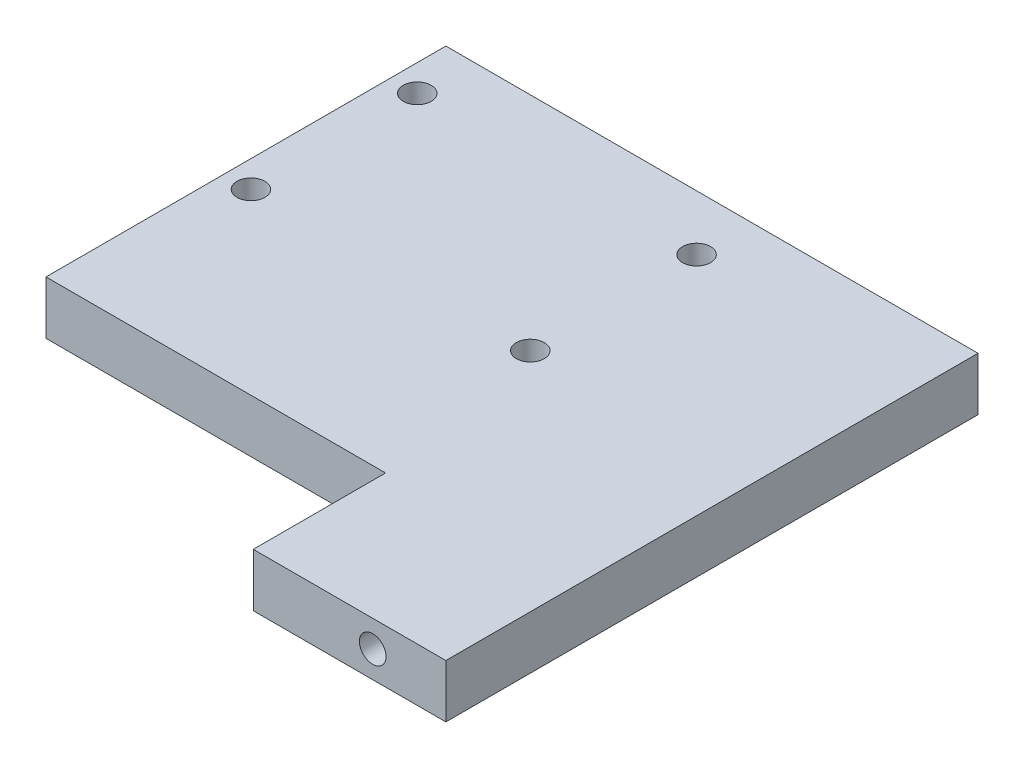
ISO-10303-21;
HEADER;
FILE_DESCRIPTION(('STEP AP214'),'2;1');
FILE_NAME('part.step','',(''),(''),'','','');
FILE_SCHEMA(('AUTOMOTIVE_DESIGN { 1 0 10303 214 1 1 1 1 }'));
ENDSEC;
DATA;
#1=APPLICATION_CONTEXT('core data for automotive mechanical design processes');
#2=APPLICATION_PROTOCOL_DEFINITION('international standard','automotive_design',2000,#1);
#3=PRODUCT_CONTEXT('',#1,'mechanical');
#4=PRODUCT('Part','Part','',(#3));
#5=PRODUCT_RELATED_PRODUCT_CATEGORY('part','',(#4));
#6=PRODUCT_DEFINITION_FORMATION('','',#4);
#7=PRODUCT_DEFINITION_CONTEXT('part definition',#1,'design');
#8=PRODUCT_DEFINITION('design','',#6,#7);
#9=PRODUCT_DEFINITION_SHAPE('','',#8);
#10=(LENGTH_UNIT() NAMED_UNIT(*) SI_UNIT(.MILLI.,.METRE.));
#11=(NAMED_UNIT(*) PLANE_ANGLE_UNIT() SI_UNIT($,.RADIAN.));
#12=(NAMED_UNIT(*) SI_UNIT($,.STERADIAN.) SOLID_ANGLE_UNIT());
#13=UNCERTAINTY_MEASURE_WITH_UNIT(LENGTH_MEASURE(1.E-05),#10,'distance_accuracy_value','');
#14=(GEOMETRIC_REPRESENTATION_CONTEXT(3) GLOBAL_UNCERTAINTY_ASSIGNED_CONTEXT((#13)) GLOBAL_UNIT_ASSIGNED_CONTEXT((#10,
#11,#12)) REPRESENTATION_CONTEXT('',''));
#15=CARTESIAN_POINT('',(0.,0.,0.));
#16=DIRECTION('',(0.,0.,1.));
#17=DIRECTION('',(1.,0.,0.));
#18=AXIS2_PLACEMENT_3D('',#15,#16,#17);
#19=CARTESIAN_POINT('',(20.,4.,20.));
#20=DIRECTION('',(-1.,0.,0.));
#21=DIRECTION('',(0.,0.,1.));
#22=AXIS2_PLACEMENT_3D('',#19,#20,#21);
#23=PLANE('',#22);
#24=DIRECTION('',(0.,0.,-1.));
#25=VECTOR('',#24,1.);
#26=CARTESIAN_POINT('',(20.,0.,20.));
#27=LINE('',#26,#25);
#28=CARTESIAN_POINT('',(20.,0.,20.));
#29=VERTEX_POINT('',#28);
#30=CARTESIAN_POINT('',(20.,0.,-20.));
#31=VERTEX_POINT('',#30);
#32=EDGE_CURVE('E140',#29,#31,#27,.T.);
#33=ORIENTED_EDGE('',*,*,#32,.T.);
#34=DIRECTION('',(0.,-1.,0.));
#35=VECTOR('',#34,1.);
#36=CARTESIAN_POINT('',(20.,4.,-20.));
#37=LINE('',#36,#35);
#38=CARTESIAN_POINT('',(20.,4.,-20.));
#39=VERTEX_POINT('',#38);
#40=EDGE_CURVE('E11',#39,#31,#37,.T.);
#41=ORIENTED_EDGE('',*,*,#40,.F.);
#42=DIRECTION('',(0.,0.,-1.));
#43=VECTOR('',#42,1.);
#44=CARTESIAN_POINT('',(20.,4.,20.));
#45=LINE('',#44,#43);
#46=CARTESIAN_POINT('',(20.,4.,20.));
#47=VERTEX_POINT('',#46);
#48=EDGE_CURVE('E136',#47,#39,#45,.T.);
#49=ORIENTED_EDGE('',*,*,#48,.F.);
#50=DIRECTION('',(0.,-1.,0.));
#51=VECTOR('',#50,1.);
#52=CARTESIAN_POINT('',(20.,4.,20.));
#53=LINE('',#52,#51);
#54=EDGE_CURVE('E134',#47,#29,#53,.T.);
#55=ORIENTED_EDGE('',*,*,#54,.T.);
#56=EDGE_LOOP('',(#33,#41,#49,#55));
#57=FACE_BOUND('',#56,.T.);
#58=ADVANCED_FACE('F34',(#57),#23,.F.);
#59=CARTESIAN_POINT('',(-20.,4.,-20.));
#60=DIRECTION('',(0.,0.,1.));
#61=DIRECTION('',(1.,0.,0.));
#62=AXIS2_PLACEMENT_3D('',#59,#60,#61);
#63=PLANE('',#62);
#64=CARTESIAN_POINT('',(-14.5,2.,-20.));
#65=DIRECTION('',(0.,0.,-1.));
#66=DIRECTION('',(-1.,0.,0.));
#67=AXIS2_PLACEMENT_3D('',#64,#65,#66);
#68=CIRCLE('',#67,1.);
#69=CARTESIAN_POINT('',(-15.5,2.,-20.));
#70=VERTEX_POINT('',#69);
#71=EDGE_CURVE('E186',#70,#70,#68,.T.);
#72=ORIENTED_EDGE('',*,*,#71,.F.);
#73=EDGE_LOOP('',(#72));
#74=FACE_BOUND('',#73,.T.);
#75=CARTESIAN_POINT('',(14.5,2.,-20.));
#76=DIRECTION('',(0.,0.,-1.));
#77=DIRECTION('',(-1.,0.,0.));
#78=AXIS2_PLACEMENT_3D('',#75,#76,#77);
#79=CIRCLE('',#78,1.);
#80=CARTESIAN_POINT('',(13.5,2.,-20.));
#81=VERTEX_POINT('',#80);
#82=EDGE_CURVE('E190',#81,#81,#79,.T.);
#83=ORIENTED_EDGE('',*,*,#82,.F.);
#84=EDGE_LOOP('',(#83));
#85=FACE_BOUND('',#84,.T.);
#86=DIRECTION('',(-1.,0.,0.));
#87=VECTOR('',#86,1.);
#88=CARTESIAN_POINT('',(-20.,0.,-20.));
#89=LINE('',#88,#87);
#90=CARTESIAN_POINT('',(-20.,0.,-20.));
#91=VERTEX_POINT('',#90);
#92=EDGE_CURVE('E143',#31,#91,#89,.T.);
#93=ORIENTED_EDGE('',*,*,#92,.T.);
#94=DIRECTION('',(0.,-1.,0.));
#95=VECTOR('',#94,1.);
#96=CARTESIAN_POINT('',(-20.,4.,-20.));
#97=LINE('',#96,#95);
#98=CARTESIAN_POINT('',(-20.,4.,-20.));
#99=VERTEX_POINT('',#98);
#100=EDGE_CURVE('E41',#99,#91,#97,.T.);
#101=ORIENTED_EDGE('',*,*,#100,.F.);
#102=DIRECTION('',(-1.,0.,0.));
#103=VECTOR('',#102,1.);
#104=CARTESIAN_POINT('',(-20.,4.,-20.));
#105=LINE('',#104,#103);
#106=EDGE_CURVE('E130',#39,#99,#105,.T.);
#107=ORIENTED_EDGE('',*,*,#106,.F.);
#108=ORIENTED_EDGE('',*,*,#40,.T.);
#109=EDGE_LOOP('',(#93,#101,#107,#108));
#110=FACE_BOUND('',#109,.T.);
#111=ADVANCED_FACE('F207',(#74,#85,#110),#63,.F.);
#112=CARTESIAN_POINT('',(-20.,4.,20.));
#113=DIRECTION('',(1.,0.,0.));
#114=DIRECTION('',(0.,0.,-1.));
#115=AXIS2_PLACEMENT_3D('',#112,#113,#114);
#116=PLANE('',#115);
#117=DIRECTION('',(0.,0.,1.));
#118=VECTOR('',#117,1.);
#119=CARTESIAN_POINT('',(-20.,0.,20.));
#120=LINE('',#119,#118);
#121=CARTESIAN_POINT('',(-20.,0.,-0.123296756228797));
#122=VERTEX_POINT('',#121);
#123=CARTESIAN_POINT('',(-20.,0.,10.0582705619843));
#124=VERTEX_POINT('',#123);
#125=EDGE_CURVE('E126',#122,#124,#120,.T.);
#126=ORIENTED_EDGE('',*,*,#125,.T.);
#127=DIRECTION('',(0.,-1.,0.));
#128=VECTOR('',#127,1.);
#129=CARTESIAN_POINT('',(-20.,4.,10.0582705619843));
#130=LINE('',#129,#128);
#131=CARTESIAN_POINT('',(-20.,4.,10.0582705619843));
#132=VERTEX_POINT('',#131);
#133=EDGE_CURVE('E48',#132,#124,#130,.T.);
#134=ORIENTED_EDGE('',*,*,#133,.F.);
#135=DIRECTION('',(0.,0.,1.));
#136=VECTOR('',#135,1.);
#137=CARTESIAN_POINT('',(-20.,4.,20.));
#138=LINE('',#137,#136);
#139=EDGE_CURVE('E124',#99,#132,#138,.T.);
#140=ORIENTED_EDGE('',*,*,#139,.F.);
#141=ORIENTED_EDGE('',*,*,#100,.T.);
#142=CARTESIAN_POINT('',(-20.,0.,-17.8471805011251));
#143=VERTEX_POINT('',#142);
#144=EDGE_CURVE('E146',#91,#143,#120,.T.);
#145=ORIENTED_EDGE('',*,*,#144,.T.);
#146=DIRECTION('',(0.,1.,0.));
#147=VECTOR('',#146,1.);
#148=CARTESIAN_POINT('',(-20.,-1.,-17.8471805011251));
#149=LINE('',#148,#147);
#150=CARTESIAN_POINT('',(-20.,-1.,-17.8471805011251));
#151=VERTEX_POINT('',#150);
#152=EDGE_CURVE('E177',#151,#143,#149,.T.);
#153=ORIENTED_EDGE('',*,*,#152,.F.);
#154=DIRECTION('',(0.,0.,-1.));
#155=VECTOR('',#154,1.);
#156=CARTESIAN_POINT('',(-20.,-1.,-0.123296756228797));
#157=LINE('',#156,#155);
#158=CARTESIAN_POINT('',(-20.,-1.,-0.123296756228797));
#159=VERTEX_POINT('',#158);
#160=EDGE_CURVE('E171',#159,#151,#157,.T.);
#161=ORIENTED_EDGE('',*,*,#160,.F.);
#162=DIRECTION('',(0.,1.,0.));
#163=VECTOR('',#162,1.);
#164=CARTESIAN_POINT('',(-20.,-1.,-0.123296756228797));
#165=LINE('',#164,#163);
#166=EDGE_CURVE('E179',#159,#122,#165,.T.);
#167=ORIENTED_EDGE('',*,*,#166,.T.);
#168=EDGE_LOOP('',(#126,#134,#140,#141,#145,#153,#161,#167));
#169=FACE_BOUND('',#168,.T.);
#170=ADVANCED_FACE('F122',(#169),#116,.F.);
#171=CARTESIAN_POINT('',(-20.,4.,20.));
#172=DIRECTION('',(0.,0.,-1.));
#173=DIRECTION('',(-1.,0.,0.));
#174=AXIS2_PLACEMENT_3D('',#171,#172,#173);
#175=PLANE('',#174);
#176=CARTESIAN_POINT('',(14.5,2.,20.));
#177=DIRECTION('',(0.,0.,1.));
#178=DIRECTION('',(1.,0.,0.));
#179=AXIS2_PLACEMENT_3D('',#176,#177,#178);
#180=CIRCLE('',#179,1.);
#181=CARTESIAN_POINT('',(15.5,2.,20.));
#182=VERTEX_POINT('',#181);
#183=EDGE_CURVE('E196',#182,#182,#180,.T.);
#184=ORIENTED_EDGE('',*,*,#183,.F.);
#185=EDGE_LOOP('',(#184));
#186=FACE_BOUND('',#185,.T.);
#187=DIRECTION('',(1.,0.,0.));
#188=VECTOR('',#187,1.);
#189=CARTESIAN_POINT('',(-20.,4.,20.));
#190=LINE('',#189,#188);
#191=CARTESIAN_POINT('',(5.52379311554674,4.,20.));
#192=VERTEX_POINT('',#191);
#193=EDGE_CURVE('E132',#192,#47,#190,.T.);
#194=ORIENTED_EDGE('',*,*,#193,.F.);
#195=DIRECTION('',(0.,-1.,0.));
#196=VECTOR('',#195,1.);
#197=CARTESIAN_POINT('',(5.52379311554674,4.,20.));
#198=LINE('',#197,#196);
#199=CARTESIAN_POINT('',(5.52379311554674,0.,20.));
#200=VERTEX_POINT('',#199);
#201=EDGE_CURVE('E290',#192,#200,#198,.T.);
#202=ORIENTED_EDGE('',*,*,#201,.T.);
#203=DIRECTION('',(1.,0.,0.));
#204=VECTOR('',#203,1.);
#205=CARTESIAN_POINT('',(-20.,0.,20.));
#206=LINE('',#205,#204);
#207=EDGE_CURVE('E149',#200,#29,#206,.T.);
#208=ORIENTED_EDGE('',*,*,#207,.T.);
#209=ORIENTED_EDGE('',*,*,#54,.F.);
#210=EDGE_LOOP('',(#194,#202,#208,#209));
#211=FACE_BOUND('',#210,.T.);
#212=ADVANCED_FACE('F214',(#186,#211),#175,.F.);
#213=CARTESIAN_POINT('',(0.,4.,0.));
#214=DIRECTION('',(0.,-1.,0.));
#215=DIRECTION('',(0.,0.,-1.));
#216=AXIS2_PLACEMENT_3D('',#213,#214,#215);
#217=PLANE('',#216);
#218=CARTESIAN_POINT('',(2.99888780924207,4.,-15.8460683103671));
#219=DIRECTION('',(0.,-1.,0.));
#220=DIRECTION('',(0.,0.,-1.));
#221=AXIS2_PLACEMENT_3D('',#218,#219,#220);
#222=CIRCLE('',#221,1.05);
#223=CARTESIAN_POINT('',(2.99888780924207,4.,-16.8960683103671));
#224=VERTEX_POINT('',#223);
#225=EDGE_CURVE('E303',#224,#224,#222,.T.);
#226=ORIENTED_EDGE('',*,*,#225,.T.);
#227=EDGE_LOOP('',(#226));
#228=FACE_BOUND('',#227,.T.);
#229=CARTESIAN_POINT('',(2.99888780924207,4.,-3.34606831036715));
#230=DIRECTION('',(0.,-1.,0.));
#231=DIRECTION('',(0.,0.,-1.));
#232=AXIS2_PLACEMENT_3D('',#229,#230,#231);
#233=CIRCLE('',#232,1.05);
#234=CARTESIAN_POINT('',(2.99888780924207,4.,-4.39606831036715));
#235=VERTEX_POINT('',#234);
#236=EDGE_CURVE('E298',#235,#235,#233,.T.);
#237=ORIENTED_EDGE('',*,*,#236,.T.);
#238=EDGE_LOOP('',(#237));
#239=FACE_BOUND('',#238,.T.);
#240=CARTESIAN_POINT('',(-17.9988878092421,4.,-3.34606831036715));
#241=DIRECTION('',(0.,-1.,0.));
#242=DIRECTION('',(0.,0.,-1.));
#243=AXIS2_PLACEMENT_3D('',#240,#241,#242);
#244=CIRCLE('',#243,1.05);
#245=CARTESIAN_POINT('',(-17.9988878092421,4.,-4.39606831036715));
#246=VERTEX_POINT('',#245);
#247=EDGE_CURVE('E295',#246,#246,#244,.T.);
#248=ORIENTED_EDGE('',*,*,#247,.T.);
#249=EDGE_LOOP('',(#248));
#250=FACE_BOUND('',#249,.T.);
#251=CARTESIAN_POINT('',(-17.9988878092421,4.,-15.8460683103671));
#252=DIRECTION('',(0.,-1.,0.));
#253=DIRECTION('',(0.,0.,-1.));
#254=AXIS2_PLACEMENT_3D('',#251,#252,#253);
#255=CIRCLE('',#254,1.05);
#256=CARTESIAN_POINT('',(-17.9988878092421,4.,-16.8960683103671));
#257=VERTEX_POINT('',#256);
#258=EDGE_CURVE('E306',#257,#257,#255,.T.);
#259=ORIENTED_EDGE('',*,*,#258,.T.);
#260=EDGE_LOOP('',(#259));
#261=FACE_BOUND('',#260,.T.);
#262=DIRECTION('',(1.,0.,0.));
#263=VECTOR('',#262,1.);
#264=CARTESIAN_POINT('',(-20.,4.,10.0582705619843));
#265=LINE('',#264,#263);
#266=CARTESIAN_POINT('',(5.52379311554674,4.,10.0582705619843));
#267=VERTEX_POINT('',#266);
#268=EDGE_CURVE('E109',#132,#267,#265,.T.);
#269=ORIENTED_EDGE('',*,*,#268,.T.);
#270=DIRECTION('',(0.,0.,1.));
#271=VECTOR('',#270,1.);
#272=CARTESIAN_POINT('',(5.52379311554674,4.,10.0582705619843));
#273=LINE('',#272,#271);
#274=EDGE_CURVE('E116',#267,#192,#273,.T.);
#275=ORIENTED_EDGE('',*,*,#274,.T.);
#276=ORIENTED_EDGE('',*,*,#193,.T.);
#277=ORIENTED_EDGE('',*,*,#48,.T.);
#278=ORIENTED_EDGE('',*,*,#106,.T.);
#279=ORIENTED_EDGE('',*,*,#139,.T.);
#280=EDGE_LOOP('',(#269,#275,#276,#277,#278,#279));
#281=FACE_BOUND('',#280,.T.);
#282=ADVANCED_FACE('F128',(#228,#239,#250,#261,#281),#217,.F.);
#283=CARTESIAN_POINT('',(0.,0.,0.));
#284=DIRECTION('',(0.,-1.,0.));
#285=DIRECTION('',(0.,0.,-1.));
#286=AXIS2_PLACEMENT_3D('',#283,#284,#285);
#287=PLANE('',#286);
#288=DIRECTION('',(0.,0.,1.));
#289=VECTOR('',#288,1.);
#290=CARTESIAN_POINT('',(5.52379311554674,0.,10.0582705619843));
#291=LINE('',#290,#289);
#292=CARTESIAN_POINT('',(5.52379311554674,0.,10.0582705619843));
#293=VERTEX_POINT('',#292);
#294=EDGE_CURVE('E117',#293,#200,#291,.T.);
#295=ORIENTED_EDGE('',*,*,#294,.F.);
#296=DIRECTION('',(1.,0.,0.));
#297=VECTOR('',#296,1.);
#298=CARTESIAN_POINT('',(-20.,0.,10.0582705619843));
#299=LINE('',#298,#297);
#300=EDGE_CURVE('E292',#124,#293,#299,.T.);
#301=ORIENTED_EDGE('',*,*,#300,.F.);
#302=ORIENTED_EDGE('',*,*,#125,.F.);
#303=DIRECTION('',(-1.,0.,0.));
#304=VECTOR('',#303,1.);
#305=CARTESIAN_POINT('',(5.,0.,-0.123296756228797));
#306=LINE('',#305,#304);
#307=CARTESIAN_POINT('',(5.,0.,-0.123296756228797));
#308=VERTEX_POINT('',#307);
#309=EDGE_CURVE('E165',#308,#122,#306,.T.);
#310=ORIENTED_EDGE('',*,*,#309,.F.);
#311=DIRECTION('',(0.,0.,1.));
#312=VECTOR('',#311,1.);
#313=CARTESIAN_POINT('',(5.,0.,-0.123296756228797));
#314=LINE('',#313,#312);
#315=CARTESIAN_POINT('',(5.,0.,-17.8471805011251));
#316=VERTEX_POINT('',#315);
#317=EDGE_CURVE('E56',#316,#308,#314,.T.);
#318=ORIENTED_EDGE('',*,*,#317,.F.);
#319=DIRECTION('',(1.,0.,0.));
#320=VECTOR('',#319,1.);
#321=CARTESIAN_POINT('',(5.,0.,-17.8471805011251));
#322=LINE('',#321,#320);
#323=EDGE_CURVE('E160',#143,#316,#322,.T.);
#324=ORIENTED_EDGE('',*,*,#323,.F.);
#325=ORIENTED_EDGE('',*,*,#144,.F.);
#326=ORIENTED_EDGE('',*,*,#92,.F.);
#327=ORIENTED_EDGE('',*,*,#32,.F.);
#328=ORIENTED_EDGE('',*,*,#207,.F.);
#329=EDGE_LOOP('',(#295,#301,#302,#310,#318,#324,#325,#326,#327,#328));
#330=FACE_BOUND('',#329,.T.);
#331=ADVANCED_FACE('F157',(#330),#287,.T.);
#332=CARTESIAN_POINT('',(14.5,2.,18.));
#333=DIRECTION('',(0.,0.,1.));
#334=DIRECTION('',(1.,0.,0.));
#335=AXIS2_PLACEMENT_3D('',#332,#333,#334);
#336=CYLINDRICAL_SURFACE('',#335,1.);
#337=CARTESIAN_POINT('',(14.5,2.,18.));
#338=DIRECTION('',(0.,0.,1.));
#339=DIRECTION('',(1.,0.,0.));
#340=AXIS2_PLACEMENT_3D('',#337,#338,#339);
#341=CIRCLE('',#340,1.);
#342=CARTESIAN_POINT('',(15.5,2.,18.));
#343=VERTEX_POINT('',#342);
#344=EDGE_CURVE('E144',#343,#343,#341,.T.);
#345=ORIENTED_EDGE('',*,*,#344,.F.);
#346=EDGE_LOOP('',(#345));
#347=FACE_BOUND('',#346,.T.);
#348=ORIENTED_EDGE('',*,*,#183,.T.);
#349=EDGE_LOOP('',(#348));
#350=FACE_BOUND('',#349,.T.);
#351=ADVANCED_FACE('F224',(#347,#350),#336,.F.);
#352=CARTESIAN_POINT('',(14.5,2.,18.));
#353=DIRECTION('',(0.,0.,1.));
#354=DIRECTION('',(1.,0.,0.));
#355=AXIS2_PLACEMENT_3D('',#352,#353,#354);
#356=PLANE('',#355);
#357=ORIENTED_EDGE('',*,*,#344,.T.);
#358=EDGE_LOOP('',(#357));
#359=FACE_BOUND('',#358,.T.);
#360=ADVANCED_FACE('F230',(#359),#356,.T.);
#361=CARTESIAN_POINT('',(14.5,2.,-18.));
#362=DIRECTION('',(0.,0.,-1.));
#363=DIRECTION('',(-1.,0.,0.));
#364=AXIS2_PLACEMENT_3D('',#361,#362,#363);
#365=CYLINDRICAL_SURFACE('',#364,1.);
#366=CARTESIAN_POINT('',(14.5,2.,-18.));
#367=DIRECTION('',(0.,0.,-1.));
#368=DIRECTION('',(-1.,0.,0.));
#369=AXIS2_PLACEMENT_3D('',#366,#367,#368);
#370=CIRCLE('',#369,1.);
#371=CARTESIAN_POINT('',(13.5,2.,-18.));
#372=VERTEX_POINT('',#371);
#373=EDGE_CURVE('E193',#372,#372,#370,.T.);
#374=ORIENTED_EDGE('',*,*,#373,.F.);
#375=EDGE_LOOP('',(#374));
#376=FACE_BOUND('',#375,.T.);
#377=ORIENTED_EDGE('',*,*,#82,.T.);
#378=EDGE_LOOP('',(#377));
#379=FACE_BOUND('',#378,.T.);
#380=ADVANCED_FACE('F234',(#376,#379),#365,.F.);
#381=CARTESIAN_POINT('',(14.5,2.,-18.));
#382=DIRECTION('',(0.,0.,-1.));
#383=DIRECTION('',(-1.,0.,0.));
#384=AXIS2_PLACEMENT_3D('',#381,#382,#383);
#385=PLANE('',#384);
#386=ORIENTED_EDGE('',*,*,#373,.T.);
#387=EDGE_LOOP('',(#386));
#388=FACE_BOUND('',#387,.T.);
#389=ADVANCED_FACE('F238',(#388),#385,.T.);
#390=CARTESIAN_POINT('',(-14.5,2.,-18.));
#391=DIRECTION('',(0.,0.,-1.));
#392=DIRECTION('',(-1.,0.,0.));
#393=AXIS2_PLACEMENT_3D('',#390,#391,#392);
#394=CYLINDRICAL_SURFACE('',#393,1.);
#395=CARTESIAN_POINT('',(-14.5,2.,-18.));
#396=DIRECTION('',(0.,0.,-1.));
#397=DIRECTION('',(-1.,0.,0.));
#398=AXIS2_PLACEMENT_3D('',#395,#396,#397);
#399=CIRCLE('',#398,1.);
#400=CARTESIAN_POINT('',(-15.5,2.,-18.));
#401=VERTEX_POINT('',#400);
#402=EDGE_CURVE('E187',#401,#401,#399,.T.);
#403=ORIENTED_EDGE('',*,*,#402,.F.);
#404=EDGE_LOOP('',(#403));
#405=FACE_BOUND('',#404,.T.);
#406=ORIENTED_EDGE('',*,*,#71,.T.);
#407=EDGE_LOOP('',(#406));
#408=FACE_BOUND('',#407,.T.);
#409=ADVANCED_FACE('F242',(#405,#408),#394,.F.);
#410=CARTESIAN_POINT('',(-14.5,2.,-18.));
#411=DIRECTION('',(0.,0.,-1.));
#412=DIRECTION('',(-1.,0.,0.));
#413=AXIS2_PLACEMENT_3D('',#410,#411,#412);
#414=PLANE('',#413);
#415=ORIENTED_EDGE('',*,*,#402,.T.);
#416=EDGE_LOOP('',(#415));
#417=FACE_BOUND('',#416,.T.);
#418=ADVANCED_FACE('F246',(#417),#414,.T.);
#419=CARTESIAN_POINT('',(0.,-1.,0.));
#420=DIRECTION('',(0.,-1.,0.));
#421=DIRECTION('',(0.,0.,-1.));
#422=AXIS2_PLACEMENT_3D('',#419,#420,#421);
#423=PLANE('',#422);
#424=CARTESIAN_POINT('',(2.99888780924207,-1.,-3.34606831036715));
#425=DIRECTION('',(0.,-1.,0.));
#426=DIRECTION('',(0.,0.,-1.));
#427=AXIS2_PLACEMENT_3D('',#424,#425,#426);
#428=CIRCLE('',#427,1.05);
#429=CARTESIAN_POINT('',(2.99888780924207,-1.,-4.39606831036715));
#430=VERTEX_POINT('',#429);
#431=EDGE_CURVE('E314',#430,#430,#428,.T.);
#432=ORIENTED_EDGE('',*,*,#431,.F.);
#433=EDGE_LOOP('',(#432));
#434=FACE_BOUND('',#433,.T.);
#435=CARTESIAN_POINT('',(-17.9988878092421,-1.,-15.8460683103671));
#436=DIRECTION('',(0.,-1.,0.));
#437=DIRECTION('',(0.,0.,-1.));
#438=AXIS2_PLACEMENT_3D('',#435,#436,#437);
#439=CIRCLE('',#438,1.05);
#440=CARTESIAN_POINT('',(-17.9988878092421,-1.,-16.8960683103671));
#441=VERTEX_POINT('',#440);
#442=EDGE_CURVE('E163',#441,#441,#439,.T.);
#443=ORIENTED_EDGE('',*,*,#442,.F.);
#444=EDGE_LOOP('',(#443));
#445=FACE_BOUND('',#444,.T.);
#446=DIRECTION('',(1.,0.,0.));
#447=VECTOR('',#446,1.);
#448=CARTESIAN_POINT('',(5.,-1.,-17.8471805011251));
#449=LINE('',#448,#447);
#450=CARTESIAN_POINT('',(5.,-1.,-17.8471805011251));
#451=VERTEX_POINT('',#450);
#452=EDGE_CURVE('E176',#151,#451,#449,.T.);
#453=ORIENTED_EDGE('',*,*,#452,.T.);
#454=DIRECTION('',(0.,0.,1.));
#455=VECTOR('',#454,1.);
#456=CARTESIAN_POINT('',(5.,-1.,-0.123296756228797));
#457=LINE('',#456,#455);
#458=CARTESIAN_POINT('',(5.,-1.,-0.123296756228797));
#459=VERTEX_POINT('',#458);
#460=EDGE_CURVE('E321',#451,#459,#457,.T.);
#461=ORIENTED_EDGE('',*,*,#460,.T.);
#462=DIRECTION('',(-1.,0.,0.));
#463=VECTOR('',#462,1.);
#464=CARTESIAN_POINT('',(5.,-1.,-0.123296756228797));
#465=LINE('',#464,#463);
#466=EDGE_CURVE('E322',#459,#159,#465,.T.);
#467=ORIENTED_EDGE('',*,*,#466,.T.);
#468=ORIENTED_EDGE('',*,*,#160,.T.);
#469=EDGE_LOOP('',(#453,#461,#467,#468));
#470=FACE_BOUND('',#469,.T.);
#471=CARTESIAN_POINT('',(2.99888780924207,-1.,-15.8460683103671));
#472=DIRECTION('',(0.,-1.,0.));
#473=DIRECTION('',(0.,0.,-1.));
#474=AXIS2_PLACEMENT_3D('',#471,#472,#473);
#475=CIRCLE('',#474,1.05);
#476=CARTESIAN_POINT('',(2.99888780924207,-1.,-16.8960683103671));
#477=VERTEX_POINT('',#476);
#478=EDGE_CURVE('E168',#477,#477,#475,.T.);
#479=ORIENTED_EDGE('',*,*,#478,.F.);
#480=EDGE_LOOP('',(#479));
#481=FACE_BOUND('',#480,.T.);
#482=CARTESIAN_POINT('',(-17.9988878092421,-1.,-3.34606831036715));
#483=DIRECTION('',(0.,-1.,0.));
#484=DIRECTION('',(0.,0.,-1.));
#485=AXIS2_PLACEMENT_3D('',#482,#483,#484);
#486=CIRCLE('',#485,1.05);
#487=CARTESIAN_POINT('',(-17.9988878092421,-1.,-4.39606831036715));
#488=VERTEX_POINT('',#487);
#489=EDGE_CURVE('E311',#488,#488,#486,.T.);
#490=ORIENTED_EDGE('',*,*,#489,.F.);
#491=EDGE_LOOP('',(#490));
#492=FACE_BOUND('',#491,.T.);
#493=ADVANCED_FACE('F250',(#434,#445,#470,#481,#492),#423,.T.);
#494=CARTESIAN_POINT('',(5.,-1.,-17.8471805011251));
#495=DIRECTION('',(0.,0.,1.));
#496=DIRECTION('',(1.,0.,0.));
#497=AXIS2_PLACEMENT_3D('',#494,#495,#496);
#498=PLANE('',#497);
#499=ORIENTED_EDGE('',*,*,#323,.T.);
#500=DIRECTION('',(0.,1.,0.));
#501=VECTOR('',#500,1.);
#502=CARTESIAN_POINT('',(5.,-1.,-17.8471805011251));
#503=LINE('',#502,#501);
#504=EDGE_CURVE('E184',#451,#316,#503,.T.);
#505=ORIENTED_EDGE('',*,*,#504,.F.);
#506=ORIENTED_EDGE('',*,*,#452,.F.);
#507=ORIENTED_EDGE('',*,*,#152,.T.);
#508=EDGE_LOOP('',(#499,#505,#506,#507));
#509=FACE_BOUND('',#508,.T.);
#510=ADVANCED_FACE('F252',(#509),#498,.F.);
#511=CARTESIAN_POINT('',(5.,-1.,-0.123296756228797));
#512=DIRECTION('',(-1.,0.,0.));
#513=DIRECTION('',(0.,0.,1.));
#514=AXIS2_PLACEMENT_3D('',#511,#512,#513);
#515=PLANE('',#514);
#516=ORIENTED_EDGE('',*,*,#317,.T.);
#517=DIRECTION('',(0.,1.,0.));
#518=VECTOR('',#517,1.);
#519=CARTESIAN_POINT('',(5.,-1.,-0.123296756228797));
#520=LINE('',#519,#518);
#521=EDGE_CURVE('E181',#459,#308,#520,.T.);
#522=ORIENTED_EDGE('',*,*,#521,.F.);
#523=ORIENTED_EDGE('',*,*,#460,.F.);
#524=ORIENTED_EDGE('',*,*,#504,.T.);
#525=EDGE_LOOP('',(#516,#522,#523,#524));
#526=FACE_BOUND('',#525,.T.);
#527=ADVANCED_FACE('F255',(#526),#515,.F.);
#528=CARTESIAN_POINT('',(5.,-1.,-0.123296756228797));
#529=DIRECTION('',(0.,0.,-1.));
#530=DIRECTION('',(-1.,0.,0.));
#531=AXIS2_PLACEMENT_3D('',#528,#529,#530);
#532=PLANE('',#531);
#533=ORIENTED_EDGE('',*,*,#309,.T.);
#534=ORIENTED_EDGE('',*,*,#166,.F.);
#535=ORIENTED_EDGE('',*,*,#466,.F.);
#536=ORIENTED_EDGE('',*,*,#521,.T.);
#537=EDGE_LOOP('',(#533,#534,#535,#536));
#538=FACE_BOUND('',#537,.T.);
#539=ADVANCED_FACE('F258',(#538),#532,.F.);
#540=CARTESIAN_POINT('',(-17.9988878092421,-1.,-15.8460683103671));
#541=DIRECTION('',(0.,1.,0.));
#542=DIRECTION('',(0.,0.,1.));
#543=AXIS2_PLACEMENT_3D('',#540,#541,#542);
#544=CYLINDRICAL_SURFACE('',#543,1.05);
#545=ORIENTED_EDGE('',*,*,#442,.T.);
#546=EDGE_LOOP('',(#545));
#547=FACE_BOUND('',#546,.T.);
#548=ORIENTED_EDGE('',*,*,#258,.F.);
#549=EDGE_LOOP('',(#548));
#550=FACE_BOUND('',#549,.T.);
#551=ADVANCED_FACE('F262',(#547,#550),#544,.F.);
#552=CARTESIAN_POINT('',(2.99888780924207,-1.,-15.8460683103671));
#553=DIRECTION('',(0.,1.,0.));
#554=DIRECTION('',(0.,0.,1.));
#555=AXIS2_PLACEMENT_3D('',#552,#553,#554);
#556=CYLINDRICAL_SURFACE('',#555,1.05);
#557=ORIENTED_EDGE('',*,*,#478,.T.);
#558=EDGE_LOOP('',(#557));
#559=FACE_BOUND('',#558,.T.);
#560=ORIENTED_EDGE('',*,*,#225,.F.);
#561=EDGE_LOOP('',(#560));
#562=FACE_BOUND('',#561,.T.);
#563=ADVANCED_FACE('F269',(#559,#562),#556,.F.);
#564=CARTESIAN_POINT('',(2.99888780924207,-1.,-3.34606831036715));
#565=DIRECTION('',(0.,1.,0.));
#566=DIRECTION('',(0.,0.,1.));
#567=AXIS2_PLACEMENT_3D('',#564,#565,#566);
#568=CYLINDRICAL_SURFACE('',#567,1.05);
#569=ORIENTED_EDGE('',*,*,#431,.T.);
#570=EDGE_LOOP('',(#569));
#571=FACE_BOUND('',#570,.T.);
#572=ORIENTED_EDGE('',*,*,#236,.F.);
#573=EDGE_LOOP('',(#572));
#574=FACE_BOUND('',#573,.T.);
#575=ADVANCED_FACE('F273',(#571,#574),#568,.F.);
#576=CARTESIAN_POINT('',(-17.9988878092421,-1.,-3.34606831036715));
#577=DIRECTION('',(0.,1.,0.));
#578=DIRECTION('',(0.,0.,1.));
#579=AXIS2_PLACEMENT_3D('',#576,#577,#578);
#580=CYLINDRICAL_SURFACE('',#579,1.05);
#581=ORIENTED_EDGE('',*,*,#489,.T.);
#582=EDGE_LOOP('',(#581));
#583=FACE_BOUND('',#582,.T.);
#584=ORIENTED_EDGE('',*,*,#247,.F.);
#585=EDGE_LOOP('',(#584));
#586=FACE_BOUND('',#585,.T.);
#587=ADVANCED_FACE('F277',(#583,#586),#580,.F.);
#588=CARTESIAN_POINT('',(5.52379311554674,4.,10.0582705619843));
#589=DIRECTION('',(1.,0.,0.));
#590=DIRECTION('',(0.,0.,-1.));
#591=AXIS2_PLACEMENT_3D('',#588,#589,#590);
#592=PLANE('',#591);
#593=ORIENTED_EDGE('',*,*,#294,.T.);
#594=ORIENTED_EDGE('',*,*,#201,.F.);
#595=ORIENTED_EDGE('',*,*,#274,.F.);
#596=DIRECTION('',(0.,-1.,0.));
#597=VECTOR('',#596,1.);
#598=CARTESIAN_POINT('',(5.52379311554674,4.,10.0582705619843));
#599=LINE('',#598,#597);
#600=EDGE_CURVE('E111',#267,#293,#599,.T.);
#601=ORIENTED_EDGE('',*,*,#600,.T.);
#602=EDGE_LOOP('',(#593,#594,#595,#601));
#603=FACE_BOUND('',#602,.T.);
#604=ADVANCED_FACE('F281',(#603),#592,.F.);
#605=CARTESIAN_POINT('',(-20.,4.,10.0582705619843));
#606=DIRECTION('',(0.,0.,-1.));
#607=DIRECTION('',(-1.,0.,0.));
#608=AXIS2_PLACEMENT_3D('',#605,#606,#607);
#609=PLANE('',#608);
#610=ORIENTED_EDGE('',*,*,#300,.T.);
#611=ORIENTED_EDGE('',*,*,#600,.F.);
#612=ORIENTED_EDGE('',*,*,#268,.F.);
#613=ORIENTED_EDGE('',*,*,#133,.T.);
#614=EDGE_LOOP('',(#610,#611,#612,#613));
#615=FACE_BOUND('',#614,.T.);
#616=ADVANCED_FACE('F110',(#615),#609,.F.);
#617=CLOSED_SHELL('',(#58,#111,#170,#212,#282,#331,#351,#360,#380,#389,#409,#418,#493,#510,#527,
#539,#551,#563,#575,#587,#604,#616));
#618=MANIFOLD_SOLID_BREP('B2',#617);
#619=ADVANCED_BREP_SHAPE_REPRESENTATION('',(#18,#618),#14);
#620=SHAPE_DEFINITION_REPRESENTATION(#9,#619);
ENDSEC;
END-ISO-10303-21;
